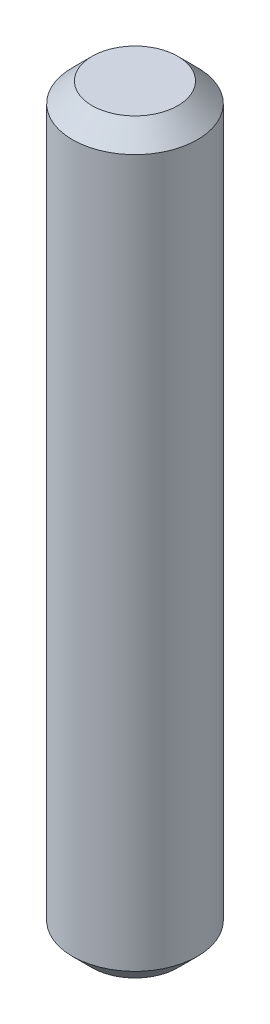
ISO-10303-21;
HEADER;
FILE_DESCRIPTION(('STEP AP214'),'2;1');
FILE_NAME('part.step','',(''),(''),'','','');
FILE_SCHEMA(('AUTOMOTIVE_DESIGN { 1 0 10303 214 1 1 1 1 }'));
ENDSEC;
DATA;
#1=APPLICATION_CONTEXT('core data for automotive mechanical design processes');
#2=APPLICATION_PROTOCOL_DEFINITION('international standard','automotive_design',2000,#1);
#3=PRODUCT_CONTEXT('',#1,'mechanical');
#4=PRODUCT('Part','Part','',(#3));
#5=PRODUCT_RELATED_PRODUCT_CATEGORY('part','',(#4));
#6=PRODUCT_DEFINITION_FORMATION('','',#4);
#7=PRODUCT_DEFINITION_CONTEXT('part definition',#1,'design');
#8=PRODUCT_DEFINITION('design','',#6,#7);
#9=PRODUCT_DEFINITION_SHAPE('','',#8);
#10=(LENGTH_UNIT() NAMED_UNIT(*) SI_UNIT(.MILLI.,.METRE.));
#11=(NAMED_UNIT(*) PLANE_ANGLE_UNIT() SI_UNIT($,.RADIAN.));
#12=(NAMED_UNIT(*) SI_UNIT($,.STERADIAN.) SOLID_ANGLE_UNIT());
#13=UNCERTAINTY_MEASURE_WITH_UNIT(LENGTH_MEASURE(1.E-05),#10,'distance_accuracy_value','');
#14=(GEOMETRIC_REPRESENTATION_CONTEXT(3) GLOBAL_UNCERTAINTY_ASSIGNED_CONTEXT((#13)) GLOBAL_UNIT_ASSIGNED_CONTEXT((#10,
#11,#12)) REPRESENTATION_CONTEXT('',''));
#15=CARTESIAN_POINT('',(0.,0.,0.));
#16=DIRECTION('',(0.,0.,1.));
#17=DIRECTION('',(1.,0.,0.));
#18=AXIS2_PLACEMENT_3D('',#15,#16,#17);
#19=CARTESIAN_POINT('',(0.,9.5,0.));
#20=DIRECTION('',(0.,-1.,0.));
#21=DIRECTION('',(0.,0.,-1.));
#22=AXIS2_PLACEMENT_3D('',#19,#20,#21);
#23=CYLINDRICAL_SURFACE('',#22,1.59);
#24=CARTESIAN_POINT('',(0.,-9.,0.));
#25=DIRECTION('',(0.,1.,0.));
#26=DIRECTION('',(0.,0.,1.));
#27=AXIS2_PLACEMENT_3D('',#24,#25,#26);
#28=CIRCLE('',#27,1.59);
#29=CARTESIAN_POINT('',(0.,-9.,1.59));
#30=VERTEX_POINT('',#29);
#31=EDGE_CURVE('E41',#30,#30,#28,.T.);
#32=ORIENTED_EDGE('',*,*,#31,.T.);
#33=EDGE_LOOP('',(#32));
#34=FACE_BOUND('',#33,.T.);
#35=CARTESIAN_POINT('',(0.,9.,0.));
#36=DIRECTION('',(0.,1.,0.));
#37=DIRECTION('',(0.,0.,1.));
#38=AXIS2_PLACEMENT_3D('',#35,#36,#37);
#39=CIRCLE('',#38,1.59);
#40=CARTESIAN_POINT('',(0.,9.,1.59));
#41=VERTEX_POINT('',#40);
#42=EDGE_CURVE('E45',#41,#41,#39,.F.);
#43=ORIENTED_EDGE('',*,*,#42,.T.);
#44=EDGE_LOOP('',(#43));
#45=FACE_BOUND('',#44,.T.);
#46=ADVANCED_FACE('F30',(#34,#45),#23,.T.);
#47=CARTESIAN_POINT('',(0.,9.5,0.));
#48=DIRECTION('',(0.,1.,0.));
#49=DIRECTION('',(0.,0.,1.));
#50=AXIS2_PLACEMENT_3D('',#47,#48,#49);
#51=PLANE('',#50);
#52=CARTESIAN_POINT('',(0.,9.5,0.));
#53=DIRECTION('',(0.,1.,0.));
#54=DIRECTION('',(0.,0.,1.));
#55=AXIS2_PLACEMENT_3D('',#52,#53,#54);
#56=CIRCLE('',#55,1.09);
#57=CARTESIAN_POINT('',(0.,9.5,1.09));
#58=VERTEX_POINT('',#57);
#59=EDGE_CURVE('E10',#58,#58,#56,.T.);
#60=ORIENTED_EDGE('',*,*,#59,.T.);
#61=EDGE_LOOP('',(#60));
#62=FACE_BOUND('',#61,.T.);
#63=ADVANCED_FACE('F61',(#62),#51,.T.);
#64=CARTESIAN_POINT('',(0.,-9.5,0.));
#65=DIRECTION('',(0.,1.,0.));
#66=DIRECTION('',(0.,0.,1.));
#67=AXIS2_PLACEMENT_3D('',#64,#65,#66);
#68=PLANE('',#67);
#69=CARTESIAN_POINT('',(0.,-9.5,0.));
#70=DIRECTION('',(0.,1.,0.));
#71=DIRECTION('',(0.,0.,1.));
#72=AXIS2_PLACEMENT_3D('',#69,#70,#71);
#73=CIRCLE('',#72,1.08999999999999);
#74=CARTESIAN_POINT('',(0.,-9.5,1.08999999999999));
#75=VERTEX_POINT('',#74);
#76=EDGE_CURVE('E37',#75,#75,#73,.F.);
#77=ORIENTED_EDGE('',*,*,#76,.T.);
#78=EDGE_LOOP('',(#77));
#79=FACE_BOUND('',#78,.T.);
#80=ADVANCED_FACE('F58',(#79),#68,.F.);
#81=CARTESIAN_POINT('',(0.,-9.,0.));
#82=DIRECTION('',(0.,1.,0.));
#83=DIRECTION('',(0.,0.,1.));
#84=AXIS2_PLACEMENT_3D('',#81,#82,#83);
#85=CONICAL_SURFACE('',#84,1.59,0.785398163397452);
#86=ORIENTED_EDGE('',*,*,#76,.F.);
#87=EDGE_LOOP('',(#86));
#88=FACE_BOUND('',#87,.T.);
#89=ORIENTED_EDGE('',*,*,#31,.F.);
#90=EDGE_LOOP('',(#89));
#91=FACE_BOUND('',#90,.T.);
#92=ADVANCED_FACE('F54',(#88,#91),#85,.T.);
#93=CARTESIAN_POINT('',(0.,9.5,0.));
#94=DIRECTION('',(0.,-1.,0.));
#95=DIRECTION('',(0.,0.,-1.));
#96=AXIS2_PLACEMENT_3D('',#93,#94,#95);
#97=CONICAL_SURFACE('',#96,1.09,0.785398163397445);
#98=ORIENTED_EDGE('',*,*,#42,.F.);
#99=EDGE_LOOP('',(#98));
#100=FACE_BOUND('',#99,.T.);
#101=ORIENTED_EDGE('',*,*,#59,.F.);
#102=EDGE_LOOP('',(#101));
#103=FACE_BOUND('',#102,.T.);
#104=ADVANCED_FACE('F32',(#100,#103),#97,.T.);
#105=CLOSED_SHELL('',(#46,#63,#80,#92,#104));
#106=MANIFOLD_SOLID_BREP('B2',#105);
#107=ADVANCED_BREP_SHAPE_REPRESENTATION('',(#18,#106),#14);
#108=SHAPE_DEFINITION_REPRESENTATION(#9,#107);
ENDSEC;
END-ISO-10303-21;
